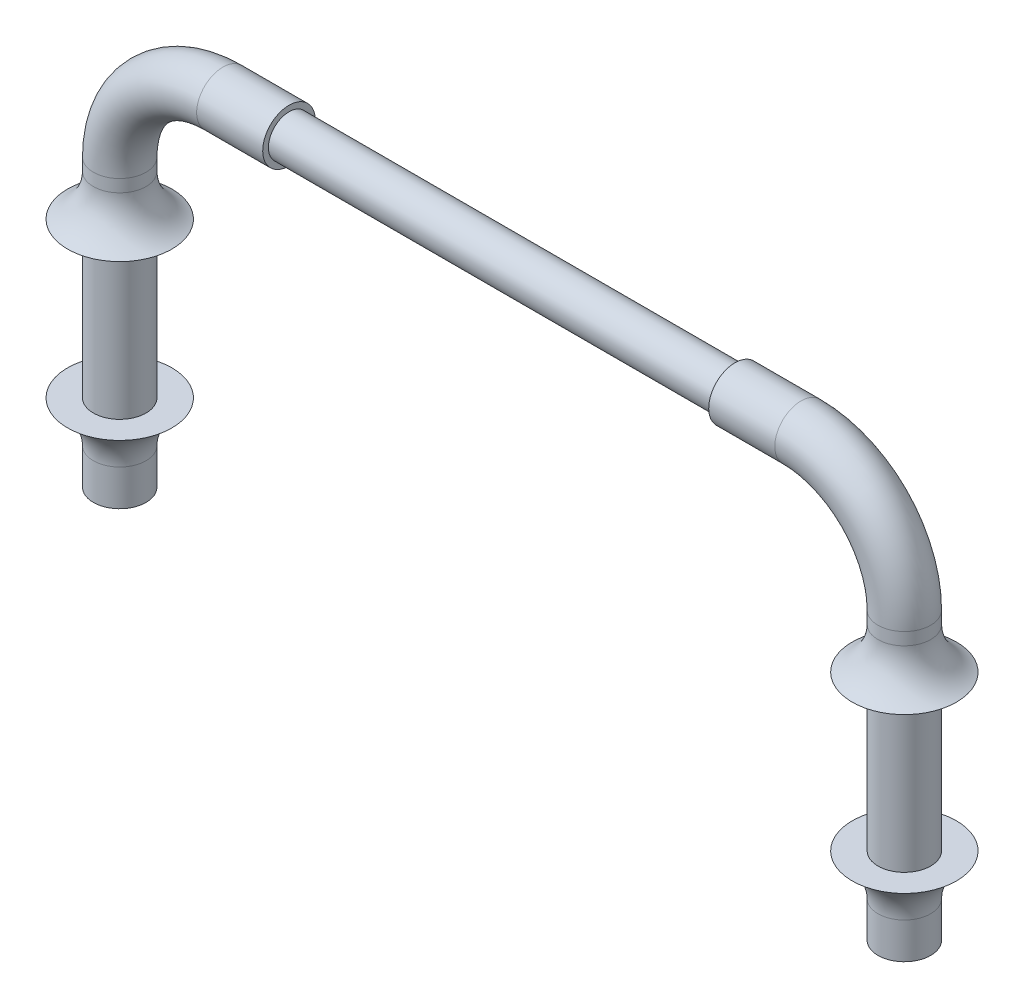
ISO-10303-21;
HEADER;
FILE_DESCRIPTION(('STEP AP214'),'2;1');
FILE_NAME('part.step','',(''),(''),'','','');
FILE_SCHEMA(('AUTOMOTIVE_DESIGN { 1 0 10303 214 1 1 1 1 }'));
ENDSEC;
DATA;
#1=APPLICATION_CONTEXT('core data for automotive mechanical design processes');
#2=APPLICATION_PROTOCOL_DEFINITION('international standard','automotive_design',2000,#1);
#3=PRODUCT_CONTEXT('',#1,'mechanical');
#4=PRODUCT('Part','Part','',(#3));
#5=PRODUCT_RELATED_PRODUCT_CATEGORY('part','',(#4));
#6=PRODUCT_DEFINITION_FORMATION('','',#4);
#7=PRODUCT_DEFINITION_CONTEXT('part definition',#1,'design');
#8=PRODUCT_DEFINITION('design','',#6,#7);
#9=PRODUCT_DEFINITION_SHAPE('','',#8);
#10=(LENGTH_UNIT() NAMED_UNIT(*) SI_UNIT(.MILLI.,.METRE.));
#11=(NAMED_UNIT(*) PLANE_ANGLE_UNIT() SI_UNIT($,.RADIAN.));
#12=(NAMED_UNIT(*) SI_UNIT($,.STERADIAN.) SOLID_ANGLE_UNIT());
#13=UNCERTAINTY_MEASURE_WITH_UNIT(LENGTH_MEASURE(1.E-05),#10,'distance_accuracy_value','');
#14=(GEOMETRIC_REPRESENTATION_CONTEXT(3) GLOBAL_UNCERTAINTY_ASSIGNED_CONTEXT((#13)) GLOBAL_UNIT_ASSIGNED_CONTEXT((#10,
#11,#12)) REPRESENTATION_CONTEXT('',''));
#15=CARTESIAN_POINT('',(0.,0.,0.));
#16=DIRECTION('',(0.,0.,1.));
#17=DIRECTION('',(1.,0.,0.));
#18=AXIS2_PLACEMENT_3D('',#15,#16,#17);
#19=CARTESIAN_POINT('',(7.59999999999998,-2.72124891681028,0.));
#20=DIRECTION('',(0.,1.,0.));
#21=DIRECTION('',(-1.,0.,0.));
#22=AXIS2_PLACEMENT_3D('',#19,#20,#21);
#23=CYLINDRICAL_SURFACE('',#22,0.255);
#24=CARTESIAN_POINT('',(7.6,0.649999999999982,0.));
#25=DIRECTION('',(0.,-1.,0.));
#26=DIRECTION('',(1.,0.,0.));
#27=AXIS2_PLACEMENT_3D('',#24,#25,#26);
#28=CIRCLE('',#27,0.25499999999998);
#29=CARTESIAN_POINT('',(7.85499999999998,0.64999999999998,0.));
#30=VERTEX_POINT('',#29);
#31=EDGE_CURVE('E87',#30,#30,#28,.T.);
#32=ORIENTED_EDGE('',*,*,#31,.F.);
#33=EDGE_LOOP('',(#32));
#34=FACE_BOUND('',#33,.T.);
#35=CARTESIAN_POINT('',(7.6,0.769999999999974,0.));
#36=DIRECTION('',(0.,-1.,0.));
#37=DIRECTION('',(1.,0.,0.));
#38=AXIS2_PLACEMENT_3D('',#35,#36,#37);
#39=CIRCLE('',#38,0.255);
#40=CARTESIAN_POINT('',(7.855,0.769999999999972,0.));
#41=VERTEX_POINT('',#40);
#42=EDGE_CURVE('E64',#41,#41,#39,.T.);
#43=ORIENTED_EDGE('',*,*,#42,.T.);
#44=EDGE_LOOP('',(#43));
#45=FACE_BOUND('',#44,.T.);
#46=ADVANCED_FACE('F28',(#34,#45),#23,.T.);
#47=CARTESIAN_POINT('',(0.,-2.,0.));
#48=DIRECTION('',(0.,1.,0.));
#49=DIRECTION('',(0.,0.,1.));
#50=AXIS2_PLACEMENT_3D('',#47,#48,#49);
#51=CYLINDRICAL_SURFACE('',#50,0.255);
#52=CARTESIAN_POINT('',(0.,0.249999999999981,0.));
#53=DIRECTION('',(0.,-1.,0.));
#54=DIRECTION('',(0.,0.,-1.));
#55=AXIS2_PLACEMENT_3D('',#52,#53,#54);
#56=CIRCLE('',#55,0.255);
#57=CARTESIAN_POINT('',(0.,0.249999999999981,-0.255));
#58=VERTEX_POINT('',#57);
#59=EDGE_CURVE('E75',#58,#58,#56,.T.);
#60=ORIENTED_EDGE('',*,*,#59,.T.);
#61=EDGE_LOOP('',(#60));
#62=FACE_BOUND('',#61,.T.);
#63=CARTESIAN_POINT('',(0.,-1.25000000000002,0.));
#64=DIRECTION('',(0.,-1.,0.));
#65=DIRECTION('',(0.,0.,-1.));
#66=AXIS2_PLACEMENT_3D('',#63,#64,#65);
#67=CIRCLE('',#66,0.255);
#68=CARTESIAN_POINT('',(0.,-1.25000000000002,-0.255));
#69=VERTEX_POINT('',#68);
#70=EDGE_CURVE('E81',#69,#69,#67,.T.);
#71=ORIENTED_EDGE('',*,*,#70,.F.);
#72=EDGE_LOOP('',(#71));
#73=FACE_BOUND('',#72,.T.);
#74=ADVANCED_FACE('F127',(#62,#73),#51,.T.);
#75=CARTESIAN_POINT('',(0.,0.77,0.));
#76=DIRECTION('',(0.,1.,0.));
#77=DIRECTION('',(0.,0.,1.));
#78=AXIS2_PLACEMENT_3D('',#75,#76,#77);
#79=CIRCLE('',#78,0.255);
#80=CARTESIAN_POINT('',(-0.255,0.77,0.));
#81=VERTEX_POINT('',#80);
#82=EDGE_CURVE('E43',#81,#81,#79,.T.);
#83=ORIENTED_EDGE('',*,*,#82,.F.);
#84=EDGE_LOOP('',(#83));
#85=FACE_BOUND('',#84,.T.);
#86=CARTESIAN_POINT('',(0.,0.64999999999998,0.));
#87=DIRECTION('',(0.,-1.,0.));
#88=DIRECTION('',(0.,0.,-1.));
#89=AXIS2_PLACEMENT_3D('',#86,#87,#88);
#90=CIRCLE('',#89,0.255);
#91=CARTESIAN_POINT('',(0.,0.64999999999998,-0.255));
#92=VERTEX_POINT('',#91);
#93=EDGE_CURVE('E78',#92,#92,#90,.T.);
#94=ORIENTED_EDGE('',*,*,#93,.F.);
#95=EDGE_LOOP('',(#94));
#96=FACE_BOUND('',#95,.T.);
#97=ADVANCED_FACE('F30',(#85,#96),#51,.T.);
#98=CARTESIAN_POINT('',(1.64,1.77,0.));
#99=DIRECTION('',(1.,0.,0.));
#100=DIRECTION('',(0.,1.,0.));
#101=AXIS2_PLACEMENT_3D('',#98,#99,#100);
#102=PLANE('',#101);
#103=CARTESIAN_POINT('',(1.64,1.77,0.));
#104=DIRECTION('',(1.,0.,0.));
#105=DIRECTION('',(0.,1.,0.));
#106=AXIS2_PLACEMENT_3D('',#103,#104,#105);
#107=CIRCLE('',#106,0.255);
#108=CARTESIAN_POINT('',(1.64,2.025,0.));
#109=VERTEX_POINT('',#108);
#110=EDGE_CURVE('E51',#109,#109,#107,.T.);
#111=ORIENTED_EDGE('',*,*,#110,.T.);
#112=EDGE_LOOP('',(#111));
#113=FACE_BOUND('',#112,.T.);
#114=CARTESIAN_POINT('',(1.64,1.77,0.));
#115=DIRECTION('',(1.,0.,0.));
#116=DIRECTION('',(0.,1.,0.));
#117=AXIS2_PLACEMENT_3D('',#114,#115,#116);
#118=CIRCLE('',#117,0.2);
#119=CARTESIAN_POINT('',(1.64,1.97,0.));
#120=VERTEX_POINT('',#119);
#121=EDGE_CURVE('E55',#120,#120,#118,.T.);
#122=ORIENTED_EDGE('',*,*,#121,.F.);
#123=EDGE_LOOP('',(#122));
#124=FACE_BOUND('',#123,.T.);
#125=ADVANCED_FACE('F186',(#113,#124),#102,.T.);
#126=CARTESIAN_POINT('',(1.,0.77,0.));
#127=DIRECTION('',(0.,0.,1.));
#128=DIRECTION('',(1.,0.,0.));
#129=AXIS2_PLACEMENT_3D('',#126,#127,#128);
#130=TOROIDAL_SURFACE('',#129,1.,0.255);
#131=CARTESIAN_POINT('',(1.,1.77,0.));
#132=DIRECTION('',(1.,0.,0.));
#133=DIRECTION('',(0.,0.,1.));
#134=AXIS2_PLACEMENT_3D('',#131,#132,#133);
#135=CIRCLE('',#134,0.255);
#136=CARTESIAN_POINT('',(1.,2.025,0.));
#137=VERTEX_POINT('',#136);
#138=EDGE_CURVE('E48',#137,#137,#135,.T.);
#139=CARTESIAN_POINT('',(1.,0.77,0.));
#140=DIRECTION('',(0.,0.,1.));
#141=DIRECTION('',(1.,0.,0.));
#142=AXIS2_PLACEMENT_3D('',#139,#140,#141);
#143=CIRCLE('',#142,1.255);
#144=EDGE_CURVE('',#137,#81,#143,.T.);
#145=ORIENTED_EDGE('',*,*,#138,.F.);
#146=ORIENTED_EDGE('',*,*,#82,.T.);
#147=ORIENTED_EDGE('',*,*,#144,.T.);
#148=ORIENTED_EDGE('',*,*,#144,.F.);
#149=EDGE_LOOP('',(#145,#147,#146,#148));
#150=FACE_BOUND('',#149,.T.);
#151=ADVANCED_FACE('F182',(#150),#130,.T.);
#152=CARTESIAN_POINT('',(1.64,1.77,0.));
#153=DIRECTION('',(-1.,0.,0.));
#154=DIRECTION('',(0.,-1.,0.));
#155=AXIS2_PLACEMENT_3D('',#152,#153,#154);
#156=CYLINDRICAL_SURFACE('',#155,0.255);
#157=ORIENTED_EDGE('',*,*,#110,.F.);
#158=EDGE_LOOP('',(#157));
#159=FACE_BOUND('',#158,.T.);
#160=ORIENTED_EDGE('',*,*,#138,.T.);
#161=EDGE_LOOP('',(#160));
#162=FACE_BOUND('',#161,.T.);
#163=ADVANCED_FACE('F185',(#159,#162),#156,.T.);
#164=CARTESIAN_POINT('',(5.96,1.76999999999998,0.));
#165=DIRECTION('',(-1.,0.,0.));
#166=DIRECTION('',(0.,-1.,0.));
#167=AXIS2_PLACEMENT_3D('',#164,#165,#166);
#168=CYLINDRICAL_SURFACE('',#167,0.2);
#169=CARTESIAN_POINT('',(5.96,1.76999999999998,0.));
#170=DIRECTION('',(1.,0.,0.));
#171=DIRECTION('',(0.,1.,0.));
#172=AXIS2_PLACEMENT_3D('',#169,#170,#171);
#173=CIRCLE('',#172,0.2);
#174=CARTESIAN_POINT('',(5.96,1.96999999999998,0.));
#175=VERTEX_POINT('',#174);
#176=EDGE_CURVE('E54',#175,#175,#173,.T.);
#177=ORIENTED_EDGE('',*,*,#176,.F.);
#178=EDGE_LOOP('',(#177));
#179=FACE_BOUND('',#178,.T.);
#180=ORIENTED_EDGE('',*,*,#121,.T.);
#181=EDGE_LOOP('',(#180));
#182=FACE_BOUND('',#181,.T.);
#183=ADVANCED_FACE('F190',(#179,#182),#168,.T.);
#184=CARTESIAN_POINT('',(5.96,1.76999999999998,0.));
#185=DIRECTION('',(1.,0.,0.));
#186=DIRECTION('',(0.,1.,0.));
#187=AXIS2_PLACEMENT_3D('',#184,#185,#186);
#188=PLANE('',#187);
#189=CARTESIAN_POINT('',(5.96,1.76999999999998,0.));
#190=DIRECTION('',(1.,0.,0.));
#191=DIRECTION('',(0.,1.,0.));
#192=AXIS2_PLACEMENT_3D('',#189,#190,#191);
#193=CIRCLE('',#192,0.255);
#194=CARTESIAN_POINT('',(5.96,2.02499999999998,0.));
#195=VERTEX_POINT('',#194);
#196=EDGE_CURVE('E61',#195,#195,#193,.T.);
#197=ORIENTED_EDGE('',*,*,#196,.F.);
#198=EDGE_LOOP('',(#197));
#199=FACE_BOUND('',#198,.T.);
#200=ORIENTED_EDGE('',*,*,#176,.T.);
#201=EDGE_LOOP('',(#200));
#202=FACE_BOUND('',#201,.T.);
#203=ADVANCED_FACE('F197',(#199,#202),#188,.F.);
#204=CARTESIAN_POINT('',(6.6,1.76999999999998,0.));
#205=DIRECTION('',(-1.,0.,0.));
#206=DIRECTION('',(0.,-1.,0.));
#207=AXIS2_PLACEMENT_3D('',#204,#205,#206);
#208=CYLINDRICAL_SURFACE('',#207,0.255);
#209=CARTESIAN_POINT('',(6.6,1.76999999999998,0.));
#210=DIRECTION('',(1.,0.,0.));
#211=DIRECTION('',(0.,1.,0.));
#212=AXIS2_PLACEMENT_3D('',#209,#210,#211);
#213=CIRCLE('',#212,0.255);
#214=CARTESIAN_POINT('',(6.6,2.02499999999998,0.));
#215=VERTEX_POINT('',#214);
#216=EDGE_CURVE('E58',#215,#215,#213,.T.);
#217=ORIENTED_EDGE('',*,*,#216,.F.);
#218=EDGE_LOOP('',(#217));
#219=FACE_BOUND('',#218,.T.);
#220=ORIENTED_EDGE('',*,*,#196,.T.);
#221=EDGE_LOOP('',(#220));
#222=FACE_BOUND('',#221,.T.);
#223=ADVANCED_FACE('F199',(#219,#222),#208,.T.);
#224=CARTESIAN_POINT('',(6.6,0.769999999999981,0.));
#225=DIRECTION('',(0.,0.,1.));
#226=DIRECTION('',(1.,0.,0.));
#227=AXIS2_PLACEMENT_3D('',#224,#225,#226);
#228=TOROIDAL_SURFACE('',#227,1.,0.255);
#229=CARTESIAN_POINT('',(6.6,0.769999999999981,0.));
#230=DIRECTION('',(0.,0.,1.));
#231=DIRECTION('',(1.,0.,0.));
#232=AXIS2_PLACEMENT_3D('',#229,#230,#231);
#233=CIRCLE('',#232,1.255);
#234=EDGE_CURVE('',#41,#215,#233,.T.);
#235=ORIENTED_EDGE('',*,*,#42,.F.);
#236=ORIENTED_EDGE('',*,*,#216,.T.);
#237=ORIENTED_EDGE('',*,*,#234,.T.);
#238=ORIENTED_EDGE('',*,*,#234,.F.);
#239=EDGE_LOOP('',(#235,#237,#236,#238));
#240=FACE_BOUND('',#239,.T.);
#241=ADVANCED_FACE('F155',(#240),#228,.T.);
#242=CARTESIAN_POINT('',(0.,0.649999999999981,0.));
#243=DIRECTION('',(0.,-1.,0.));
#244=DIRECTION('',(0.,0.,-1.));
#245=AXIS2_PLACEMENT_3D('',#242,#243,#244);
#246=TOROIDAL_SURFACE('',#245,0.7,0.445);
#247=CARTESIAN_POINT('',(0.,0.249999999999981,0.));
#248=DIRECTION('',(0.,-1.,0.));
#249=DIRECTION('',(0.,0.,-1.));
#250=AXIS2_PLACEMENT_3D('',#247,#248,#249);
#251=CIRCLE('',#250,0.505);
#252=CARTESIAN_POINT('',(0.,0.249999999999981,-0.505));
#253=VERTEX_POINT('',#252);
#254=EDGE_CURVE('E72',#253,#253,#251,.T.);
#255=ORIENTED_EDGE('',*,*,#254,.F.);
#256=EDGE_LOOP('',(#255));
#257=FACE_BOUND('',#256,.T.);
#258=ORIENTED_EDGE('',*,*,#93,.T.);
#259=EDGE_LOOP('',(#258));
#260=FACE_BOUND('',#259,.T.);
#261=ADVANCED_FACE('F151',(#257,#260),#246,.F.);
#262=CARTESIAN_POINT('',(-0.255,0.249999999999981,0.));
#263=DIRECTION('',(0.,1.,0.));
#264=DIRECTION('',(0.,0.,1.));
#265=AXIS2_PLACEMENT_3D('',#262,#263,#264);
#266=PLANE('',#265);
#267=ORIENTED_EDGE('',*,*,#59,.F.);
#268=EDGE_LOOP('',(#267));
#269=FACE_BOUND('',#268,.T.);
#270=ORIENTED_EDGE('',*,*,#254,.T.);
#271=EDGE_LOOP('',(#270));
#272=FACE_BOUND('',#271,.T.);
#273=ADVANCED_FACE('F154',(#269,#272),#266,.F.);
#274=CARTESIAN_POINT('',(0.,-1.65000000000002,0.));
#275=DIRECTION('',(0.,-1.,0.));
#276=DIRECTION('',(0.,0.,-1.));
#277=AXIS2_PLACEMENT_3D('',#274,#275,#276);
#278=TOROIDAL_SURFACE('',#277,0.7,0.445);
#279=CARTESIAN_POINT('',(0.,-1.65000000000002,0.));
#280=DIRECTION('',(0.,1.,0.));
#281=DIRECTION('',(0.,0.,1.));
#282=AXIS2_PLACEMENT_3D('',#279,#280,#281);
#283=CIRCLE('',#282,0.255);
#284=CARTESIAN_POINT('',(0.,-1.65000000000002,0.255));
#285=VERTEX_POINT('',#284);
#286=EDGE_CURVE('E35',#285,#285,#283,.T.);
#287=ORIENTED_EDGE('',*,*,#286,.T.);
#288=EDGE_LOOP('',(#287));
#289=FACE_BOUND('',#288,.T.);
#290=CARTESIAN_POINT('',(0.,-1.25000000000002,0.));
#291=DIRECTION('',(0.,-1.,0.));
#292=DIRECTION('',(0.,0.,-1.));
#293=AXIS2_PLACEMENT_3D('',#290,#291,#292);
#294=CIRCLE('',#293,0.505);
#295=CARTESIAN_POINT('',(0.,-1.25000000000002,-0.505));
#296=VERTEX_POINT('',#295);
#297=EDGE_CURVE('E84',#296,#296,#294,.T.);
#298=ORIENTED_EDGE('',*,*,#297,.T.);
#299=EDGE_LOOP('',(#298));
#300=FACE_BOUND('',#299,.T.);
#301=ADVANCED_FACE('F159',(#289,#300),#278,.F.);
#302=CARTESIAN_POINT('',(-0.255,-1.25000000000002,0.));
#303=DIRECTION('',(0.,-1.,0.));
#304=DIRECTION('',(0.,0.,-1.));
#305=AXIS2_PLACEMENT_3D('',#302,#303,#304);
#306=PLANE('',#305);
#307=ORIENTED_EDGE('',*,*,#297,.F.);
#308=EDGE_LOOP('',(#307));
#309=FACE_BOUND('',#308,.T.);
#310=ORIENTED_EDGE('',*,*,#70,.T.);
#311=EDGE_LOOP('',(#310));
#312=FACE_BOUND('',#311,.T.);
#313=ADVANCED_FACE('F163',(#309,#312),#306,.F.);
#314=CARTESIAN_POINT('',(0.,-2.,0.));
#315=DIRECTION('',(0.,1.,0.));
#316=DIRECTION('',(0.,0.,1.));
#317=AXIS2_PLACEMENT_3D('',#314,#315,#316);
#318=PLANE('',#317);
#319=CARTESIAN_POINT('',(0.,-2.,0.));
#320=DIRECTION('',(0.,1.,0.));
#321=DIRECTION('',(0.,0.,1.));
#322=AXIS2_PLACEMENT_3D('',#319,#320,#321);
#323=CIRCLE('',#322,0.255);
#324=CARTESIAN_POINT('',(0.,-2.,0.255));
#325=VERTEX_POINT('',#324);
#326=EDGE_CURVE('E39',#325,#325,#323,.T.);
#327=ORIENTED_EDGE('',*,*,#326,.F.);
#328=EDGE_LOOP('',(#327));
#329=FACE_BOUND('',#328,.T.);
#330=ADVANCED_FACE('F165',(#329),#318,.F.);
#331=ORIENTED_EDGE('',*,*,#286,.F.);
#332=EDGE_LOOP('',(#331));
#333=FACE_BOUND('',#332,.T.);
#334=ORIENTED_EDGE('',*,*,#326,.T.);
#335=EDGE_LOOP('',(#334));
#336=FACE_BOUND('',#335,.T.);
#337=ADVANCED_FACE('F122',(#333,#336),#51,.T.);
#338=CARTESIAN_POINT('',(7.6,0.649999999999983,0.));
#339=DIRECTION('',(0.,-1.,0.));
#340=DIRECTION('',(1.,0.,0.));
#341=AXIS2_PLACEMENT_3D('',#338,#339,#340);
#342=TOROIDAL_SURFACE('',#341,0.699999999999974,0.444999999999994);
#343=ORIENTED_EDGE('',*,*,#31,.T.);
#344=EDGE_LOOP('',(#343));
#345=FACE_BOUND('',#344,.T.);
#346=CARTESIAN_POINT('',(7.6,0.249999999999984,0.));
#347=DIRECTION('',(0.,-1.,0.));
#348=DIRECTION('',(1.,0.,0.));
#349=AXIS2_PLACEMENT_3D('',#346,#347,#348);
#350=CIRCLE('',#349,0.504999999999985);
#351=CARTESIAN_POINT('',(8.10499999999998,0.249999999999981,0.));
#352=VERTEX_POINT('',#351);
#353=EDGE_CURVE('E90',#352,#352,#350,.T.);
#354=ORIENTED_EDGE('',*,*,#353,.F.);
#355=EDGE_LOOP('',(#354));
#356=FACE_BOUND('',#355,.T.);
#357=ADVANCED_FACE('F116',(#345,#356),#342,.F.);
#358=CARTESIAN_POINT('',(7.85499999999998,0.249999999999982,0.));
#359=DIRECTION('',(0.,-1.,0.));
#360=DIRECTION('',(1.,0.,0.));
#361=AXIS2_PLACEMENT_3D('',#358,#359,#360);
#362=PLANE('',#361);
#363=ORIENTED_EDGE('',*,*,#353,.T.);
#364=EDGE_LOOP('',(#363));
#365=FACE_BOUND('',#364,.T.);
#366=CARTESIAN_POINT('',(7.6,0.249999999999982,0.));
#367=DIRECTION('',(0.,-1.,0.));
#368=DIRECTION('',(1.,0.,0.));
#369=AXIS2_PLACEMENT_3D('',#366,#367,#368);
#370=CIRCLE('',#369,0.254999999999985);
#371=CARTESIAN_POINT('',(7.85499999999998,0.249999999999981,0.));
#372=VERTEX_POINT('',#371);
#373=EDGE_CURVE('E93',#372,#372,#370,.T.);
#374=ORIENTED_EDGE('',*,*,#373,.F.);
#375=EDGE_LOOP('',(#374));
#376=FACE_BOUND('',#375,.T.);
#377=ADVANCED_FACE('F110',(#365,#376),#362,.T.);
#378=CARTESIAN_POINT('',(7.59999999999999,-1.25000000000002,0.));
#379=DIRECTION('',(0.,-1.,0.));
#380=DIRECTION('',(1.,0.,0.));
#381=AXIS2_PLACEMENT_3D('',#378,#379,#380);
#382=CIRCLE('',#381,0.254999999999995);
#383=CARTESIAN_POINT('',(7.85499999999998,-1.25000000000002,0.));
#384=VERTEX_POINT('',#383);
#385=EDGE_CURVE('E99',#384,#384,#382,.T.);
#386=ORIENTED_EDGE('',*,*,#385,.F.);
#387=EDGE_LOOP('',(#386));
#388=FACE_BOUND('',#387,.T.);
#389=ORIENTED_EDGE('',*,*,#373,.T.);
#390=EDGE_LOOP('',(#389));
#391=FACE_BOUND('',#390,.T.);
#392=ADVANCED_FACE('F106',(#388,#391),#23,.T.);
#393=CARTESIAN_POINT('',(7.59999999999998,-1.65000000000002,0.));
#394=DIRECTION('',(0.,-1.,0.));
#395=DIRECTION('',(1.,0.,0.));
#396=AXIS2_PLACEMENT_3D('',#393,#394,#395);
#397=TOROIDAL_SURFACE('',#396,0.700000000000006,0.445000000000006);
#398=CARTESIAN_POINT('',(7.59999999999999,-1.25000000000002,0.));
#399=DIRECTION('',(0.,-1.,0.));
#400=DIRECTION('',(1.,0.,0.));
#401=AXIS2_PLACEMENT_3D('',#398,#399,#400);
#402=CIRCLE('',#401,0.504999999999995);
#403=CARTESIAN_POINT('',(8.10499999999998,-1.25000000000002,0.));
#404=VERTEX_POINT('',#403);
#405=EDGE_CURVE('E96',#404,#404,#402,.T.);
#406=ORIENTED_EDGE('',*,*,#405,.T.);
#407=EDGE_LOOP('',(#406));
#408=FACE_BOUND('',#407,.T.);
#409=CARTESIAN_POINT('',(7.59999999999998,-1.65000000000002,0.));
#410=DIRECTION('',(0.,1.,0.));
#411=DIRECTION('',(-1.,0.,0.));
#412=AXIS2_PLACEMENT_3D('',#409,#410,#411);
#413=CIRCLE('',#412,0.255);
#414=CARTESIAN_POINT('',(7.34499999999999,-1.65000000000002,0.));
#415=VERTEX_POINT('',#414);
#416=EDGE_CURVE('E10',#415,#415,#413,.T.);
#417=ORIENTED_EDGE('',*,*,#416,.T.);
#418=EDGE_LOOP('',(#417));
#419=FACE_BOUND('',#418,.T.);
#420=ADVANCED_FACE('F109',(#408,#419),#397,.F.);
#421=CARTESIAN_POINT('',(7.85499999999998,-1.25000000000002,0.));
#422=DIRECTION('',(0.,1.,0.));
#423=DIRECTION('',(-1.,0.,0.));
#424=AXIS2_PLACEMENT_3D('',#421,#422,#423);
#425=PLANE('',#424);
#426=ORIENTED_EDGE('',*,*,#385,.T.);
#427=EDGE_LOOP('',(#426));
#428=FACE_BOUND('',#427,.T.);
#429=ORIENTED_EDGE('',*,*,#405,.F.);
#430=EDGE_LOOP('',(#429));
#431=FACE_BOUND('',#430,.T.);
#432=ADVANCED_FACE('F103',(#428,#431),#425,.T.);
#433=CARTESIAN_POINT('',(0.,-2.,0.));
#434=DIRECTION('',(0.,1.,0.));
#435=DIRECTION('',(0.,0.,1.));
#436=AXIS2_PLACEMENT_3D('',#433,#434,#435);
#437=PLANE('',#436);
#438=CARTESIAN_POINT('',(7.59999999999998,-2.,0.));
#439=DIRECTION('',(0.,1.,0.));
#440=DIRECTION('',(0.,0.,1.));
#441=AXIS2_PLACEMENT_3D('',#438,#439,#440);
#442=CIRCLE('',#441,0.255);
#443=CARTESIAN_POINT('',(7.59999999999998,-2.,0.255));
#444=VERTEX_POINT('',#443);
#445=EDGE_CURVE('E69',#444,#444,#442,.T.);
#446=ORIENTED_EDGE('',*,*,#445,.F.);
#447=EDGE_LOOP('',(#446));
#448=FACE_BOUND('',#447,.T.);
#449=ADVANCED_FACE('F138',(#448),#437,.F.);
#450=ORIENTED_EDGE('',*,*,#445,.T.);
#451=EDGE_LOOP('',(#450));
#452=FACE_BOUND('',#451,.T.);
#453=ORIENTED_EDGE('',*,*,#416,.F.);
#454=EDGE_LOOP('',(#453));
#455=FACE_BOUND('',#454,.T.);
#456=ADVANCED_FACE('F112',(#452,#455),#23,.T.);
#457=CLOSED_SHELL('',(#46,#74,#97,#125,#151,#163,#183,#203,#223,#241,#261,#273,#301,#313,#330,
#337,#357,#377,#392,#420,#432,#449,#456));
#458=MANIFOLD_SOLID_BREP('B2',#457);
#459=ADVANCED_BREP_SHAPE_REPRESENTATION('',(#18,#458),#14);
#460=SHAPE_DEFINITION_REPRESENTATION(#9,#459);
ENDSEC;
END-ISO-10303-21;
